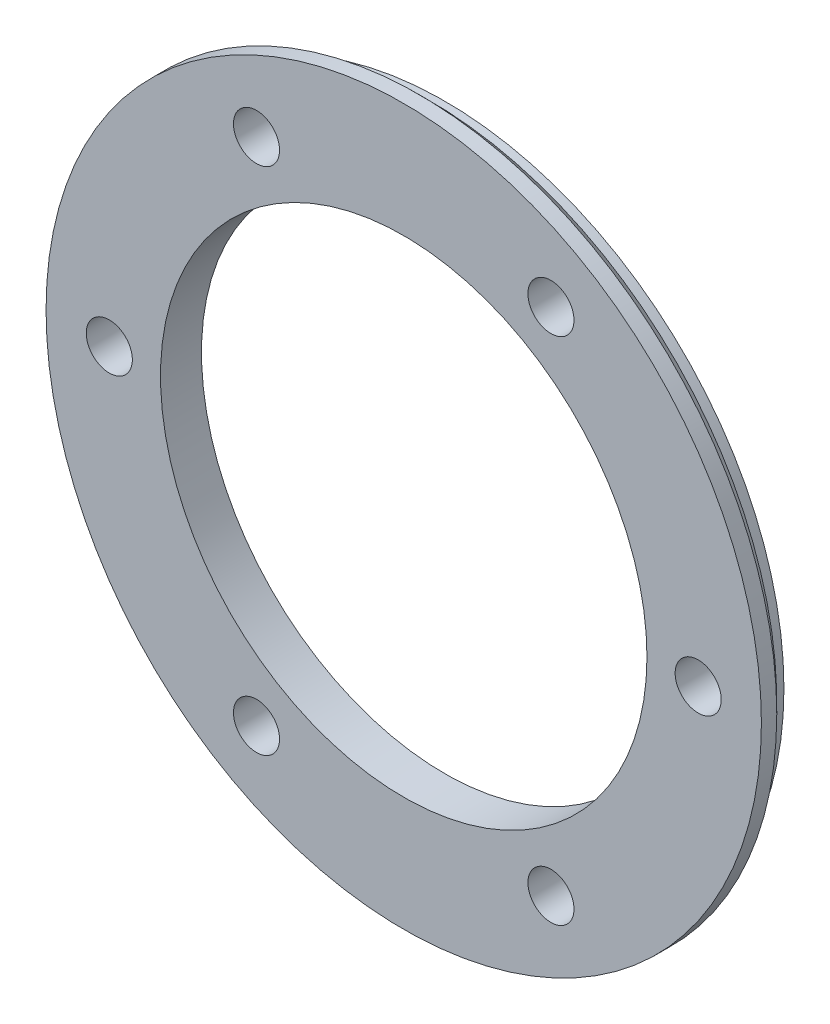
ISO-10303-21;
HEADER;
FILE_DESCRIPTION(('STEP AP214'),'2;1');
FILE_NAME('part.step','',(''),(''),'','','');
FILE_SCHEMA(('AUTOMOTIVE_DESIGN { 1 0 10303 214 1 1 1 1 }'));
ENDSEC;
DATA;
#1=APPLICATION_CONTEXT('core data for automotive mechanical design processes');
#2=APPLICATION_PROTOCOL_DEFINITION('international standard','automotive_design',2000,#1);
#3=PRODUCT_CONTEXT('',#1,'mechanical');
#4=PRODUCT('Part','Part','',(#3));
#5=PRODUCT_RELATED_PRODUCT_CATEGORY('part','',(#4));
#6=PRODUCT_DEFINITION_FORMATION('','',#4);
#7=PRODUCT_DEFINITION_CONTEXT('part definition',#1,'design');
#8=PRODUCT_DEFINITION('design','',#6,#7);
#9=PRODUCT_DEFINITION_SHAPE('','',#8);
#10=(LENGTH_UNIT() NAMED_UNIT(*) SI_UNIT(.MILLI.,.METRE.));
#11=(NAMED_UNIT(*) PLANE_ANGLE_UNIT() SI_UNIT($,.RADIAN.));
#12=(NAMED_UNIT(*) SI_UNIT($,.STERADIAN.) SOLID_ANGLE_UNIT());
#13=UNCERTAINTY_MEASURE_WITH_UNIT(LENGTH_MEASURE(1.E-05),#10,'distance_accuracy_value','');
#14=(GEOMETRIC_REPRESENTATION_CONTEXT(3) GLOBAL_UNCERTAINTY_ASSIGNED_CONTEXT((#13)) GLOBAL_UNIT_ASSIGNED_CONTEXT((#10,
#11,#12)) REPRESENTATION_CONTEXT('',''));
#15=CARTESIAN_POINT('',(0.,0.,0.));
#16=DIRECTION('',(0.,0.,1.));
#17=DIRECTION('',(1.,0.,0.));
#18=AXIS2_PLACEMENT_3D('',#15,#16,#17);
#19=CARTESIAN_POINT('',(0.,0.,-113.));
#20=DIRECTION('',(0.,0.,1.));
#21=DIRECTION('',(1.,0.,0.));
#22=AXIS2_PLACEMENT_3D('',#19,#20,#21);
#23=PLANE('',#22);
#24=CARTESIAN_POINT('',(28.75,49.7964607176052,-113.));
#25=DIRECTION('',(0.,0.,-1.));
#26=DIRECTION('',(-1.,0.,0.));
#27=AXIS2_PLACEMENT_3D('',#24,#25,#26);
#28=CIRCLE('',#27,4.5);
#29=CARTESIAN_POINT('',(24.25,49.7964607176052,-113.));
#30=VERTEX_POINT('',#29);
#31=EDGE_CURVE('E91',#30,#30,#28,.T.);
#32=ORIENTED_EDGE('',*,*,#31,.T.);
#33=EDGE_LOOP('',(#32));
#34=FACE_BOUND('',#33,.T.);
#35=CARTESIAN_POINT('',(-57.5,0.,-113.));
#36=DIRECTION('',(0.,0.,-1.));
#37=DIRECTION('',(-1.,0.,0.));
#38=AXIS2_PLACEMENT_3D('',#35,#36,#37);
#39=CIRCLE('',#38,4.5);
#40=CARTESIAN_POINT('',(-62.,0.,-113.));
#41=VERTEX_POINT('',#40);
#42=EDGE_CURVE('E85',#41,#41,#39,.T.);
#43=ORIENTED_EDGE('',*,*,#42,.T.);
#44=EDGE_LOOP('',(#43));
#45=FACE_BOUND('',#44,.T.);
#46=CARTESIAN_POINT('',(-28.75,-49.796460717605,-113.));
#47=DIRECTION('',(0.,0.,-1.));
#48=DIRECTION('',(-1.,0.,0.));
#49=AXIS2_PLACEMENT_3D('',#46,#47,#48);
#50=CIRCLE('',#49,4.5);
#51=CARTESIAN_POINT('',(-33.25,-49.796460717605,-113.));
#52=VERTEX_POINT('',#51);
#53=EDGE_CURVE('E79',#52,#52,#50,.T.);
#54=ORIENTED_EDGE('',*,*,#53,.T.);
#55=EDGE_LOOP('',(#54));
#56=FACE_BOUND('',#55,.T.);
#57=CARTESIAN_POINT('',(-28.75,49.7964607176052,-113.));
#58=DIRECTION('',(0.,0.,-1.));
#59=DIRECTION('',(-1.,0.,0.));
#60=AXIS2_PLACEMENT_3D('',#57,#58,#59);
#61=CIRCLE('',#60,4.49999999999999);
#62=CARTESIAN_POINT('',(-33.25,49.7964607176052,-113.));
#63=VERTEX_POINT('',#62);
#64=EDGE_CURVE('E76',#63,#63,#61,.T.);
#65=ORIENTED_EDGE('',*,*,#64,.T.);
#66=EDGE_LOOP('',(#65));
#67=FACE_BOUND('',#66,.T.);
#68=CARTESIAN_POINT('',(28.75,-49.796460717605,-113.));
#69=DIRECTION('',(0.,0.,-1.));
#70=DIRECTION('',(-1.,0.,0.));
#71=AXIS2_PLACEMENT_3D('',#68,#69,#70);
#72=CIRCLE('',#71,4.49999999999999);
#73=CARTESIAN_POINT('',(24.25,-49.796460717605,-113.));
#74=VERTEX_POINT('',#73);
#75=EDGE_CURVE('E70',#74,#74,#72,.T.);
#76=ORIENTED_EDGE('',*,*,#75,.T.);
#77=EDGE_LOOP('',(#76));
#78=FACE_BOUND('',#77,.T.);
#79=CARTESIAN_POINT('',(0.,0.,-113.));
#80=DIRECTION('',(0.,0.,1.));
#81=DIRECTION('',(1.,0.,0.));
#82=AXIS2_PLACEMENT_3D('',#79,#80,#81);
#83=CIRCLE('',#82,69.85);
#84=CARTESIAN_POINT('',(69.85,0.,-113.));
#85=VERTEX_POINT('',#84);
#86=EDGE_CURVE('E58',#85,#85,#83,.T.);
#87=ORIENTED_EDGE('',*,*,#86,.T.);
#88=EDGE_LOOP('',(#87));
#89=FACE_BOUND('',#88,.T.);
#90=CARTESIAN_POINT('',(0.,0.,-113.));
#91=DIRECTION('',(0.,0.,1.));
#92=DIRECTION('',(1.,0.,0.));
#93=AXIS2_PLACEMENT_3D('',#90,#91,#92);
#94=CIRCLE('',#93,47.5);
#95=CARTESIAN_POINT('',(47.5,0.,-113.));
#96=VERTEX_POINT('',#95);
#97=EDGE_CURVE('E61',#96,#96,#94,.T.);
#98=ORIENTED_EDGE('',*,*,#97,.F.);
#99=EDGE_LOOP('',(#98));
#100=FACE_BOUND('',#99,.T.);
#101=CARTESIAN_POINT('',(57.5,0.,-113.));
#102=DIRECTION('',(0.,0.,-1.));
#103=DIRECTION('',(-1.,0.,0.));
#104=AXIS2_PLACEMENT_3D('',#101,#102,#103);
#105=CIRCLE('',#104,4.5);
#106=CARTESIAN_POINT('',(53.,0.,-113.));
#107=VERTEX_POINT('',#106);
#108=EDGE_CURVE('E97',#107,#107,#105,.T.);
#109=ORIENTED_EDGE('',*,*,#108,.T.);
#110=EDGE_LOOP('',(#109));
#111=FACE_BOUND('',#110,.T.);
#112=ADVANCED_FACE('F38',(#34,#45,#56,#67,#78,#89,#100,#111),#23,.T.);
#113=CARTESIAN_POINT('',(0.,0.,-121.));
#114=DIRECTION('',(0.,0.,-1.));
#115=DIRECTION('',(-1.,0.,0.));
#116=AXIS2_PLACEMENT_3D('',#113,#114,#115);
#117=PLANE('',#116);
#118=CARTESIAN_POINT('',(57.5,0.,-121.));
#119=DIRECTION('',(0.,0.,-1.));
#120=DIRECTION('',(-1.,0.,0.));
#121=AXIS2_PLACEMENT_3D('',#118,#119,#120);
#122=CIRCLE('',#121,4.5);
#123=CARTESIAN_POINT('',(53.,0.,-121.));
#124=VERTEX_POINT('',#123);
#125=EDGE_CURVE('E100',#124,#124,#122,.T.);
#126=ORIENTED_EDGE('',*,*,#125,.F.);
#127=EDGE_LOOP('',(#126));
#128=FACE_BOUND('',#127,.T.);
#129=CARTESIAN_POINT('',(28.75,49.7964607176052,-121.));
#130=DIRECTION('',(0.,0.,-1.));
#131=DIRECTION('',(-1.,0.,0.));
#132=AXIS2_PLACEMENT_3D('',#129,#130,#131);
#133=CIRCLE('',#132,4.5);
#134=CARTESIAN_POINT('',(24.25,49.7964607176052,-121.));
#135=VERTEX_POINT('',#134);
#136=EDGE_CURVE('E94',#135,#135,#133,.T.);
#137=ORIENTED_EDGE('',*,*,#136,.F.);
#138=EDGE_LOOP('',(#137));
#139=FACE_BOUND('',#138,.T.);
#140=CARTESIAN_POINT('',(-57.5,0.,-121.));
#141=DIRECTION('',(0.,0.,-1.));
#142=DIRECTION('',(-1.,0.,0.));
#143=AXIS2_PLACEMENT_3D('',#140,#141,#142);
#144=CIRCLE('',#143,4.5);
#145=CARTESIAN_POINT('',(-62.,0.,-121.));
#146=VERTEX_POINT('',#145);
#147=EDGE_CURVE('E88',#146,#146,#144,.T.);
#148=ORIENTED_EDGE('',*,*,#147,.F.);
#149=EDGE_LOOP('',(#148));
#150=FACE_BOUND('',#149,.T.);
#151=CARTESIAN_POINT('',(-28.75,-49.796460717605,-121.));
#152=DIRECTION('',(0.,0.,-1.));
#153=DIRECTION('',(-1.,0.,0.));
#154=AXIS2_PLACEMENT_3D('',#151,#152,#153);
#155=CIRCLE('',#154,4.5);
#156=CARTESIAN_POINT('',(-33.25,-49.796460717605,-121.));
#157=VERTEX_POINT('',#156);
#158=EDGE_CURVE('E82',#157,#157,#155,.T.);
#159=ORIENTED_EDGE('',*,*,#158,.F.);
#160=EDGE_LOOP('',(#159));
#161=FACE_BOUND('',#160,.T.);
#162=CARTESIAN_POINT('',(-28.75,49.7964607176052,-121.));
#163=DIRECTION('',(0.,0.,-1.));
#164=DIRECTION('',(-1.,0.,0.));
#165=AXIS2_PLACEMENT_3D('',#162,#163,#164);
#166=CIRCLE('',#165,4.49999999999999);
#167=CARTESIAN_POINT('',(-33.25,49.7964607176052,-121.));
#168=VERTEX_POINT('',#167);
#169=EDGE_CURVE('E73',#168,#168,#166,.T.);
#170=ORIENTED_EDGE('',*,*,#169,.F.);
#171=EDGE_LOOP('',(#170));
#172=FACE_BOUND('',#171,.T.);
#173=CARTESIAN_POINT('',(28.75,-49.796460717605,-121.));
#174=DIRECTION('',(0.,0.,-1.));
#175=DIRECTION('',(-1.,0.,0.));
#176=AXIS2_PLACEMENT_3D('',#173,#174,#175);
#177=CIRCLE('',#176,4.49999999999999);
#178=CARTESIAN_POINT('',(24.25,-49.796460717605,-121.));
#179=VERTEX_POINT('',#178);
#180=EDGE_CURVE('E67',#179,#179,#177,.T.);
#181=ORIENTED_EDGE('',*,*,#180,.F.);
#182=EDGE_LOOP('',(#181));
#183=FACE_BOUND('',#182,.T.);
#184=CARTESIAN_POINT('',(0.,0.,-121.));
#185=DIRECTION('',(0.,0.,1.));
#186=DIRECTION('',(1.,0.,0.));
#187=AXIS2_PLACEMENT_3D('',#184,#185,#186);
#188=CIRCLE('',#187,47.5);
#189=CARTESIAN_POINT('',(47.5,0.,-121.));
#190=VERTEX_POINT('',#189);
#191=EDGE_CURVE('E64',#190,#190,#188,.T.);
#192=ORIENTED_EDGE('',*,*,#191,.T.);
#193=EDGE_LOOP('',(#192));
#194=FACE_BOUND('',#193,.T.);
#195=CARTESIAN_POINT('',(0.,0.,-121.));
#196=DIRECTION('',(0.,0.,1.));
#197=DIRECTION('',(1.,0.,0.));
#198=AXIS2_PLACEMENT_3D('',#195,#196,#197);
#199=CIRCLE('',#198,66.25);
#200=CARTESIAN_POINT('',(66.25,0.,-121.));
#201=VERTEX_POINT('',#200);
#202=EDGE_CURVE('E49',#201,#201,#199,.T.);
#203=ORIENTED_EDGE('',*,*,#202,.F.);
#204=EDGE_LOOP('',(#203));
#205=FACE_BOUND('',#204,.T.);
#206=ADVANCED_FACE('F106',(#128,#139,#150,#161,#172,#183,#194,#205),#117,.T.);
#207=CARTESIAN_POINT('',(0.,0.,0.));
#208=DIRECTION('',(0.,0.,1.));
#209=DIRECTION('',(1.,0.,0.));
#210=AXIS2_PLACEMENT_3D('',#207,#208,#209);
#211=CYLINDRICAL_SURFACE('',#210,66.25);
#212=ORIENTED_EDGE('',*,*,#202,.T.);
#213=EDGE_LOOP('',(#212));
#214=FACE_BOUND('',#213,.T.);
#215=CARTESIAN_POINT('',(0.,0.,-118.));
#216=DIRECTION('',(0.,0.,1.));
#217=DIRECTION('',(1.,0.,0.));
#218=AXIS2_PLACEMENT_3D('',#215,#216,#217);
#219=CIRCLE('',#218,66.25);
#220=CARTESIAN_POINT('',(66.25,0.,-118.));
#221=VERTEX_POINT('',#220);
#222=EDGE_CURVE('E53',#221,#221,#219,.T.);
#223=ORIENTED_EDGE('',*,*,#222,.F.);
#224=EDGE_LOOP('',(#223));
#225=FACE_BOUND('',#224,.T.);
#226=ADVANCED_FACE('F109',(#214,#225),#211,.T.);
#227=CARTESIAN_POINT('',(0.,-4.44089209850063E-13,-118.));
#228=DIRECTION('',(0.,0.,-1.));
#229=DIRECTION('',(-1.,0.,0.));
#230=AXIS2_PLACEMENT_3D('',#227,#228,#229);
#231=PLANE('',#230);
#232=CARTESIAN_POINT('',(0.,0.,-118.));
#233=DIRECTION('',(0.,0.,-1.));
#234=DIRECTION('',(-1.,0.,0.));
#235=AXIS2_PLACEMENT_3D('',#232,#233,#234);
#236=CIRCLE('',#235,67.85);
#237=CARTESIAN_POINT('',(-67.85,0.,-118.));
#238=VERTEX_POINT('',#237);
#239=EDGE_CURVE('E11',#238,#238,#236,.T.);
#240=ORIENTED_EDGE('',*,*,#239,.T.);
#241=EDGE_LOOP('',(#240));
#242=FACE_BOUND('',#241,.T.);
#243=ORIENTED_EDGE('',*,*,#222,.T.);
#244=EDGE_LOOP('',(#243));
#245=FACE_BOUND('',#244,.T.);
#246=ADVANCED_FACE('F126',(#242,#245),#231,.T.);
#247=CARTESIAN_POINT('',(0.,0.,0.));
#248=DIRECTION('',(0.,0.,1.));
#249=DIRECTION('',(1.,0.,0.));
#250=AXIS2_PLACEMENT_3D('',#247,#248,#249);
#251=CYLINDRICAL_SURFACE('',#250,69.85);
#252=CARTESIAN_POINT('',(0.,0.,-116.));
#253=DIRECTION('',(0.,0.,-1.));
#254=DIRECTION('',(-1.,0.,0.));
#255=AXIS2_PLACEMENT_3D('',#252,#253,#254);
#256=CIRCLE('',#255,69.85);
#257=CARTESIAN_POINT('',(-69.85,0.,-116.));
#258=VERTEX_POINT('',#257);
#259=EDGE_CURVE('E45',#258,#258,#256,.F.);
#260=ORIENTED_EDGE('',*,*,#259,.T.);
#261=EDGE_LOOP('',(#260));
#262=FACE_BOUND('',#261,.T.);
#263=ORIENTED_EDGE('',*,*,#86,.F.);
#264=EDGE_LOOP('',(#263));
#265=FACE_BOUND('',#264,.T.);
#266=ADVANCED_FACE('F131',(#262,#265),#251,.T.);
#267=CARTESIAN_POINT('',(0.,0.,0.));
#268=DIRECTION('',(0.,0.,1.));
#269=DIRECTION('',(1.,0.,0.));
#270=AXIS2_PLACEMENT_3D('',#267,#268,#269);
#271=CYLINDRICAL_SURFACE('',#270,47.5);
#272=ORIENTED_EDGE('',*,*,#97,.T.);
#273=EDGE_LOOP('',(#272));
#274=FACE_BOUND('',#273,.T.);
#275=ORIENTED_EDGE('',*,*,#191,.F.);
#276=EDGE_LOOP('',(#275));
#277=FACE_BOUND('',#276,.T.);
#278=ADVANCED_FACE('F136',(#274,#277),#271,.F.);
#279=CARTESIAN_POINT('',(28.75,-49.796460717605,-149.));
#280=DIRECTION('',(0.,0.,-1.));
#281=DIRECTION('',(-1.,0.,0.));
#282=AXIS2_PLACEMENT_3D('',#279,#280,#281);
#283=CYLINDRICAL_SURFACE('',#282,4.49999999999999);
#284=ORIENTED_EDGE('',*,*,#180,.T.);
#285=EDGE_LOOP('',(#284));
#286=FACE_BOUND('',#285,.T.);
#287=ORIENTED_EDGE('',*,*,#75,.F.);
#288=EDGE_LOOP('',(#287));
#289=FACE_BOUND('',#288,.T.);
#290=ADVANCED_FACE('F147',(#286,#289),#283,.F.);
#291=CARTESIAN_POINT('',(-28.75,49.7964607176052,-149.));
#292=DIRECTION('',(0.,0.,-1.));
#293=DIRECTION('',(-1.,0.,0.));
#294=AXIS2_PLACEMENT_3D('',#291,#292,#293);
#295=CYLINDRICAL_SURFACE('',#294,4.49999999999999);
#296=ORIENTED_EDGE('',*,*,#169,.T.);
#297=EDGE_LOOP('',(#296));
#298=FACE_BOUND('',#297,.T.);
#299=ORIENTED_EDGE('',*,*,#64,.F.);
#300=EDGE_LOOP('',(#299));
#301=FACE_BOUND('',#300,.T.);
#302=ADVANCED_FACE('F151',(#298,#301),#295,.F.);
#303=CARTESIAN_POINT('',(0.,0.,-116.));
#304=DIRECTION('',(0.,0.,1.));
#305=DIRECTION('',(1.,0.,0.));
#306=AXIS2_PLACEMENT_3D('',#303,#304,#305);
#307=CONICAL_SURFACE('',#306,69.85,0.785398163397452);
#308=ORIENTED_EDGE('',*,*,#239,.F.);
#309=EDGE_LOOP('',(#308));
#310=FACE_BOUND('',#309,.T.);
#311=ORIENTED_EDGE('',*,*,#259,.F.);
#312=EDGE_LOOP('',(#311));
#313=FACE_BOUND('',#312,.T.);
#314=ADVANCED_FACE('F40',(#310,#313),#307,.T.);
#315=CARTESIAN_POINT('',(-28.75,-49.796460717605,-121.));
#316=DIRECTION('',(0.,0.,-1.));
#317=DIRECTION('',(-1.,0.,0.));
#318=AXIS2_PLACEMENT_3D('',#315,#316,#317);
#319=CYLINDRICAL_SURFACE('',#318,4.5);
#320=ORIENTED_EDGE('',*,*,#53,.F.);
#321=EDGE_LOOP('',(#320));
#322=FACE_BOUND('',#321,.T.);
#323=ORIENTED_EDGE('',*,*,#158,.T.);
#324=EDGE_LOOP('',(#323));
#325=FACE_BOUND('',#324,.T.);
#326=ADVANCED_FACE('F156',(#322,#325),#319,.F.);
#327=CARTESIAN_POINT('',(-57.5,0.,-121.));
#328=DIRECTION('',(0.,0.,-1.));
#329=DIRECTION('',(-1.,0.,0.));
#330=AXIS2_PLACEMENT_3D('',#327,#328,#329);
#331=CYLINDRICAL_SURFACE('',#330,4.5);
#332=ORIENTED_EDGE('',*,*,#42,.F.);
#333=EDGE_LOOP('',(#332));
#334=FACE_BOUND('',#333,.T.);
#335=ORIENTED_EDGE('',*,*,#147,.T.);
#336=EDGE_LOOP('',(#335));
#337=FACE_BOUND('',#336,.T.);
#338=ADVANCED_FACE('F159',(#334,#337),#331,.F.);
#339=CARTESIAN_POINT('',(28.75,49.7964607176052,-121.));
#340=DIRECTION('',(0.,0.,-1.));
#341=DIRECTION('',(-1.,0.,0.));
#342=AXIS2_PLACEMENT_3D('',#339,#340,#341);
#343=CYLINDRICAL_SURFACE('',#342,4.5);
#344=ORIENTED_EDGE('',*,*,#31,.F.);
#345=EDGE_LOOP('',(#344));
#346=FACE_BOUND('',#345,.T.);
#347=ORIENTED_EDGE('',*,*,#136,.T.);
#348=EDGE_LOOP('',(#347));
#349=FACE_BOUND('',#348,.T.);
#350=ADVANCED_FACE('F163',(#346,#349),#343,.F.);
#351=CARTESIAN_POINT('',(57.5,0.,-121.));
#352=DIRECTION('',(0.,0.,-1.));
#353=DIRECTION('',(-1.,0.,0.));
#354=AXIS2_PLACEMENT_3D('',#351,#352,#353);
#355=CYLINDRICAL_SURFACE('',#354,4.5);
#356=ORIENTED_EDGE('',*,*,#108,.F.);
#357=EDGE_LOOP('',(#356));
#358=FACE_BOUND('',#357,.T.);
#359=ORIENTED_EDGE('',*,*,#125,.T.);
#360=EDGE_LOOP('',(#359));
#361=FACE_BOUND('',#360,.T.);
#362=ADVANCED_FACE('F104',(#358,#361),#355,.F.);
#363=CLOSED_SHELL('',(#112,#206,#226,#246,#266,#278,#290,#302,#314,#326,#338,#350,#362));
#364=MANIFOLD_SOLID_BREP('B2',#363);
#365=ADVANCED_BREP_SHAPE_REPRESENTATION('',(#18,#364),#14);
#366=SHAPE_DEFINITION_REPRESENTATION(#9,#365);
ENDSEC;
END-ISO-10303-21;
